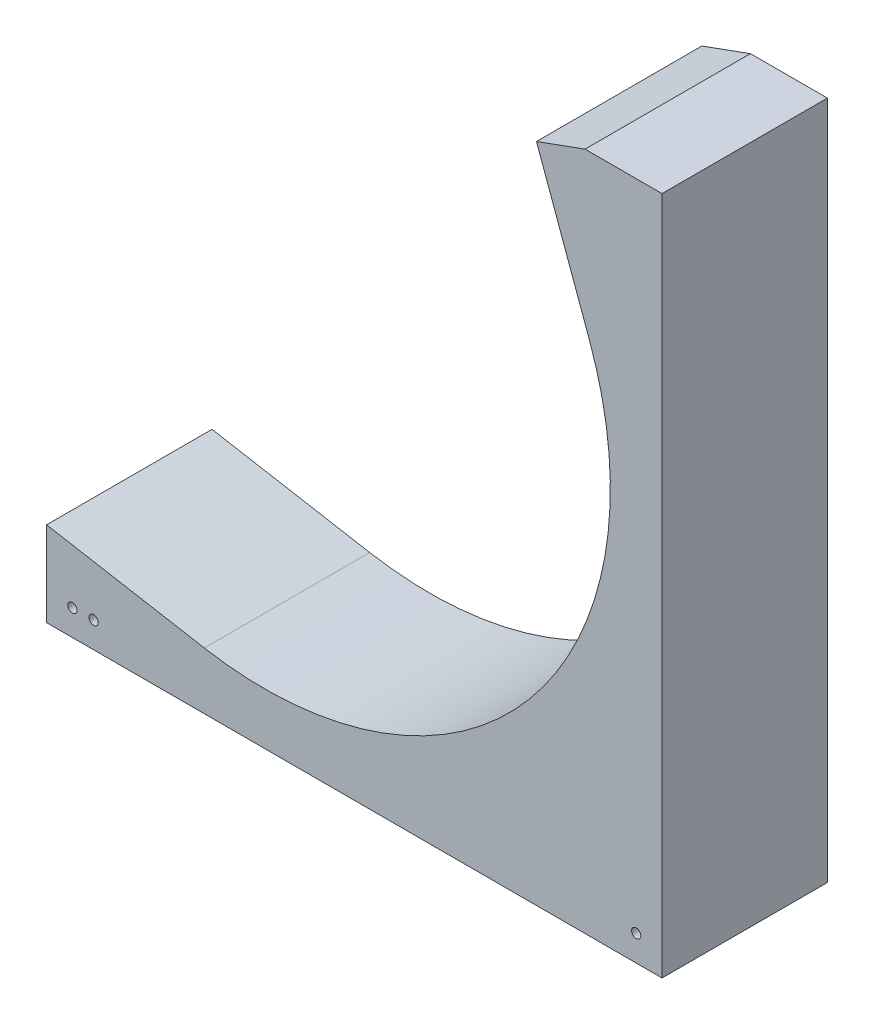
ISO-10303-21;
HEADER;
FILE_DESCRIPTION(('STEP AP214'),'2;1');
FILE_NAME('part.step','',(''),(''),'','','');
FILE_SCHEMA(('AUTOMOTIVE_DESIGN { 1 0 10303 214 1 1 1 1 }'));
ENDSEC;
DATA;
#1=APPLICATION_CONTEXT('core data for automotive mechanical design processes');
#2=APPLICATION_PROTOCOL_DEFINITION('international standard','automotive_design',2000,#1);
#3=PRODUCT_CONTEXT('',#1,'mechanical');
#4=PRODUCT('Part','Part','',(#3));
#5=PRODUCT_RELATED_PRODUCT_CATEGORY('part','',(#4));
#6=PRODUCT_DEFINITION_FORMATION('','',#4);
#7=PRODUCT_DEFINITION_CONTEXT('part definition',#1,'design');
#8=PRODUCT_DEFINITION('design','',#6,#7);
#9=PRODUCT_DEFINITION_SHAPE('','',#8);
#10=(LENGTH_UNIT() NAMED_UNIT(*) SI_UNIT(.MILLI.,.METRE.));
#11=(NAMED_UNIT(*) PLANE_ANGLE_UNIT() SI_UNIT($,.RADIAN.));
#12=(NAMED_UNIT(*) SI_UNIT($,.STERADIAN.) SOLID_ANGLE_UNIT());
#13=UNCERTAINTY_MEASURE_WITH_UNIT(LENGTH_MEASURE(1.E-05),#10,'distance_accuracy_value','');
#14=(GEOMETRIC_REPRESENTATION_CONTEXT(3) GLOBAL_UNCERTAINTY_ASSIGNED_CONTEXT((#13)) GLOBAL_UNIT_ASSIGNED_CONTEXT((#10,
#11,#12)) REPRESENTATION_CONTEXT('',''));
#15=CARTESIAN_POINT('',(0.,0.,0.));
#16=DIRECTION('',(0.,0.,1.));
#17=DIRECTION('',(1.,0.,0.));
#18=AXIS2_PLACEMENT_3D('',#15,#16,#17);
#19=CARTESIAN_POINT('',(-13.0309674607081,35.802288851943,0.));
#20=DIRECTION('',(0.342020143325672,-0.939692620785908,0.));
#21=DIRECTION('',(0.939692620785908,0.342020143325672,0.));
#22=AXIS2_PLACEMENT_3D('',#19,#20,#21);
#23=PLANE('',#22);
#24=DIRECTION('',(0.,0.,1.));
#25=VECTOR('',#24,1.);
#26=CARTESIAN_POINT('',(78.789969348242,69.2223767328391,-20.3199999999999));
#27=LINE('',#26,#25);
#28=CARTESIAN_POINT('',(78.7899693482419,69.2223767328391,-20.3200000000004));
#29=VERTEX_POINT('',#28);
#30=CARTESIAN_POINT('',(78.7899693482419,69.2223767328391,20.3199999999999));
#31=VERTEX_POINT('',#30);
#32=EDGE_CURVE('E189',#29,#31,#27,.T.);
#33=ORIENTED_EDGE('',*,*,#32,.F.);
#34=DIRECTION('',(0.939692620785907,0.342020143325671,0.));
#35=VECTOR('',#34,1.);
#36=CARTESIAN_POINT('',(78.789969348242,69.2223767328391,-20.3199999999999));
#37=LINE('',#36,#35);
#38=CARTESIAN_POINT('',(66.8558730642609,64.878720912603,-20.32));
#39=VERTEX_POINT('',#38);
#40=EDGE_CURVE('E207',#39,#29,#37,.T.);
#41=ORIENTED_EDGE('',*,*,#40,.F.);
#42=DIRECTION('',(0.,0.,-1.));
#43=VECTOR('',#42,1.);
#44=CARTESIAN_POINT('',(66.8558730642609,64.878720912603,-20.32));
#45=LINE('',#44,#43);
#46=CARTESIAN_POINT('',(66.8558730642608,64.878720912603,20.3200000000001));
#47=VERTEX_POINT('',#46);
#48=EDGE_CURVE('E202',#47,#39,#45,.T.);
#49=ORIENTED_EDGE('',*,*,#48,.F.);
#50=DIRECTION('',(-0.939692620785908,-0.342020143325672,0.));
#51=VECTOR('',#50,1.);
#52=CARTESIAN_POINT('',(78.7899693482419,69.2223767328391,20.3200000000001));
#53=LINE('',#52,#51);
#54=EDGE_CURVE('E192',#31,#47,#53,.T.);
#55=ORIENTED_EDGE('',*,*,#54,.F.);
#56=EDGE_LOOP('',(#33,#41,#49,#55));
#57=FACE_BOUND('',#56,.T.);
#58=ADVANCED_FACE('F93',(#57),#23,.F.);
#59=CARTESIAN_POINT('',(78.7899693482419,69.2223767328391,20.3200000000001));
#60=DIRECTION('',(0.,0.,1.));
#61=DIRECTION('',(1.,0.,0.));
#62=AXIS2_PLACEMENT_3D('',#59,#60,#61);
#63=PLANE('',#62);
#64=CARTESIAN_POINT('',(-47.1742910089514,-91.3638000000001,20.3199999999999));
#65=DIRECTION('',(0.,0.,1.));
#66=DIRECTION('',(1.,0.,0.));
#67=AXIS2_PLACEMENT_3D('',#64,#65,#66);
#68=CIRCLE('',#67,1.13030000000002);
#69=CARTESIAN_POINT('',(-46.0439910089514,-91.3638000000001,20.3199999999999));
#70=VERTEX_POINT('',#69);
#71=EDGE_CURVE('E365',#70,#70,#68,.T.);
#72=ORIENTED_EDGE('',*,*,#71,.F.);
#73=EDGE_LOOP('',(#72));
#74=FACE_BOUND('',#73,.T.);
#75=DIRECTION('',(-0.984807753012208,0.17364817766693,0.));
#76=VECTOR('',#75,1.);
#77=CARTESIAN_POINT('',(-14.7624914465408,-83.7222493530292,20.3200000000001));
#78=LINE('',#77,#76);
#79=CARTESIAN_POINT('',(-14.7624914465409,-83.7222493530292,20.3200000000001));
#80=VERTEX_POINT('',#79);
#81=CARTESIAN_POINT('',(-53.5242910089514,-76.8874982693626,20.3199999999999));
#82=VERTEX_POINT('',#81);
#83=EDGE_CURVE('E101',#80,#82,#78,.T.);
#84=ORIENTED_EDGE('',*,*,#83,.T.);
#85=DIRECTION('',(0.,1.,0.));
#86=VECTOR('',#85,1.);
#87=CARTESIAN_POINT('',(-53.5242910089514,-97.7138,20.3199999999999));
#88=LINE('',#87,#86);
#89=CARTESIAN_POINT('',(-53.5242910089514,-97.7138,20.3199999999999));
#90=VERTEX_POINT('',#89);
#91=EDGE_CURVE('E169',#90,#82,#88,.T.);
#92=ORIENTED_EDGE('',*,*,#91,.F.);
#93=DIRECTION('',(1.,0.,0.));
#94=VECTOR('',#93,1.);
#95=CARTESIAN_POINT('',(0.,-97.7137999999999,20.3199999999999));
#96=LINE('',#95,#94);
#97=CARTESIAN_POINT('',(97.7138,-97.7137999999999,20.3199999999999));
#98=VERTEX_POINT('',#97);
#99=EDGE_CURVE('E180',#90,#98,#96,.T.);
#100=ORIENTED_EDGE('',*,*,#99,.T.);
#101=DIRECTION('',(0.,1.,0.));
#102=VECTOR('',#101,1.);
#103=CARTESIAN_POINT('',(97.7138,0.,20.3199999999999));
#104=LINE('',#103,#102);
#105=CARTESIAN_POINT('',(97.7137999999999,69.2223767328391,20.3199999999999));
#106=VERTEX_POINT('',#105);
#107=EDGE_CURVE('E197',#98,#106,#104,.T.);
#108=ORIENTED_EDGE('',*,*,#107,.T.);
#109=DIRECTION('',(-1.,0.,0.));
#110=VECTOR('',#109,1.);
#111=CARTESIAN_POINT('',(0.,69.2223767328391,20.3199999999999));
#112=LINE('',#111,#110);
#113=EDGE_CURVE('E251',#106,#31,#112,.T.);
#114=ORIENTED_EDGE('',*,*,#113,.T.);
#115=ORIENTED_EDGE('',*,*,#54,.T.);
#116=DIRECTION('',(0.342020143325672,-0.939692620785907,0.));
#117=VECTOR('',#116,1.);
#118=CARTESIAN_POINT('',(66.8558730642608,64.878720912603,20.3200000000001));
#119=LINE('',#118,#117);
#120=CARTESIAN_POINT('',(79.8868405249689,29.07643206066,20.3200000000001));
#121=VERTEX_POINT('',#120);
#122=EDGE_CURVE('E206',#47,#121,#119,.T.);
#123=ORIENTED_EDGE('',*,*,#122,.T.);
#124=CARTESIAN_POINT('',(0.,0.,20.3200000000001));
#125=DIRECTION('',(0.,0.,-1.));
#126=DIRECTION('',(0.939692620785907,0.342020143325673,0.));
#127=AXIS2_PLACEMENT_3D('',#124,#125,#126);
#128=CIRCLE('',#127,85.0137999999999);
#129=EDGE_CURVE('E213',#121,#80,#128,.T.);
#130=ORIENTED_EDGE('',*,*,#129,.T.);
#131=EDGE_LOOP('',(#84,#92,#100,#108,#114,#115,#123,#130));
#132=FACE_BOUND('',#131,.T.);
#133=CARTESIAN_POINT('',(91.3637999999999,-91.3638000000001,20.3199999999999));
#134=DIRECTION('',(0.,0.,1.));
#135=DIRECTION('',(1.,0.,0.));
#136=AXIS2_PLACEMENT_3D('',#133,#134,#135);
#137=CIRCLE('',#136,1.1303);
#138=CARTESIAN_POINT('',(92.4940999999999,-91.3638000000001,20.3199999999999));
#139=VERTEX_POINT('',#138);
#140=EDGE_CURVE('E252',#139,#139,#137,.T.);
#141=ORIENTED_EDGE('',*,*,#140,.F.);
#142=EDGE_LOOP('',(#141));
#143=FACE_BOUND('',#142,.T.);
#144=CARTESIAN_POINT('',(-41.9735000000001,-91.3638000000001,20.3199999999999));
#145=DIRECTION('',(0.,0.,1.));
#146=DIRECTION('',(1.,0.,0.));
#147=AXIS2_PLACEMENT_3D('',#144,#145,#146);
#148=CIRCLE('',#147,1.13030000000001);
#149=CARTESIAN_POINT('',(-40.8432000000001,-91.3638000000001,20.3199999999999));
#150=VERTEX_POINT('',#149);
#151=EDGE_CURVE('E242',#150,#150,#148,.T.);
#152=ORIENTED_EDGE('',*,*,#151,.F.);
#153=EDGE_LOOP('',(#152));
#154=FACE_BOUND('',#153,.T.);
#155=ADVANCED_FACE('F178',(#74,#132,#143,#154),#63,.T.);
#156=CARTESIAN_POINT('',(66.8558730642609,64.878720912603,-20.32));
#157=DIRECTION('',(-0.939692620785907,-0.342020143325672,0.));
#158=DIRECTION('',(0.342020143325672,-0.939692620785907,0.));
#159=AXIS2_PLACEMENT_3D('',#156,#157,#158);
#160=PLANE('',#159);
#161=DIRECTION('',(0.342020143325672,-0.939692620785907,0.));
#162=VECTOR('',#161,1.);
#163=CARTESIAN_POINT('',(66.8558730642609,64.878720912603,-20.32));
#164=LINE('',#163,#162);
#165=CARTESIAN_POINT('',(79.886840524969,29.0764320606601,-20.32));
#166=VERTEX_POINT('',#165);
#167=EDGE_CURVE('E223',#39,#166,#164,.T.);
#168=ORIENTED_EDGE('',*,*,#167,.T.);
#169=DIRECTION('',(0.,0.,-1.));
#170=VECTOR('',#169,1.);
#171=CARTESIAN_POINT('',(79.886840524969,29.0764320606601,-20.32));
#172=LINE('',#171,#170);
#173=EDGE_CURVE('E210',#121,#166,#172,.T.);
#174=ORIENTED_EDGE('',*,*,#173,.F.);
#175=ORIENTED_EDGE('',*,*,#122,.F.);
#176=ORIENTED_EDGE('',*,*,#48,.T.);
#177=EDGE_LOOP('',(#168,#174,#175,#176));
#178=FACE_BOUND('',#177,.T.);
#179=ADVANCED_FACE('F277',(#178),#160,.T.);
#180=CARTESIAN_POINT('',(78.789969348242,69.2223767328391,-20.3199999999999));
#181=DIRECTION('',(0.,0.,-1.));
#182=DIRECTION('',(-1.,0.,0.));
#183=AXIS2_PLACEMENT_3D('',#180,#181,#182);
#184=PLANE('',#183);
#185=CARTESIAN_POINT('',(-47.1742910089514,-91.3638000000001,-20.3200000000004));
#186=DIRECTION('',(0.,0.,1.));
#187=DIRECTION('',(1.,0.,0.));
#188=AXIS2_PLACEMENT_3D('',#185,#186,#187);
#189=CIRCLE('',#188,1.13030000000002);
#190=CARTESIAN_POINT('',(-46.0439910089514,-91.3638000000001,-20.3200000000004));
#191=VERTEX_POINT('',#190);
#192=EDGE_CURVE('E183',#191,#191,#189,.T.);
#193=ORIENTED_EDGE('',*,*,#192,.T.);
#194=EDGE_LOOP('',(#193));
#195=FACE_BOUND('',#194,.T.);
#196=ORIENTED_EDGE('',*,*,#167,.F.);
#197=ORIENTED_EDGE('',*,*,#40,.T.);
#198=DIRECTION('',(-1.,0.,0.));
#199=VECTOR('',#198,1.);
#200=CARTESIAN_POINT('',(0.,69.2223767328391,-20.3200000000003));
#201=LINE('',#200,#199);
#202=CARTESIAN_POINT('',(97.7137999999999,69.2223767328391,-20.3200000000003));
#203=VERTEX_POINT('',#202);
#204=EDGE_CURVE('E260',#203,#29,#201,.T.);
#205=ORIENTED_EDGE('',*,*,#204,.F.);
#206=DIRECTION('',(0.,1.,0.));
#207=VECTOR('',#206,1.);
#208=CARTESIAN_POINT('',(97.7138,3.88578058618805E-13,-20.3200000000002));
#209=LINE('',#208,#207);
#210=CARTESIAN_POINT('',(97.7138,-97.7137999999999,-20.32));
#211=VERTEX_POINT('',#210);
#212=EDGE_CURVE('E194',#211,#203,#209,.T.);
#213=ORIENTED_EDGE('',*,*,#212,.F.);
#214=DIRECTION('',(1.,0.,0.));
#215=VECTOR('',#214,1.);
#216=CARTESIAN_POINT('',(0.,-97.7137999999999,-20.3199999999999));
#217=LINE('',#216,#215);
#218=CARTESIAN_POINT('',(-53.5242910089514,-97.7137999999999,-20.3199999999999));
#219=VERTEX_POINT('',#218);
#220=EDGE_CURVE('E190',#219,#211,#217,.T.);
#221=ORIENTED_EDGE('',*,*,#220,.F.);
#222=DIRECTION('',(0.,1.,0.));
#223=VECTOR('',#222,1.);
#224=CARTESIAN_POINT('',(-53.5242910089514,-97.7138,-20.3200000000004));
#225=LINE('',#224,#223);
#226=CARTESIAN_POINT('',(-53.5242910089514,-76.8874982693628,-20.3200000000004));
#227=VERTEX_POINT('',#226);
#228=EDGE_CURVE('E109',#219,#227,#225,.T.);
#229=ORIENTED_EDGE('',*,*,#228,.T.);
#230=DIRECTION('',(-0.984807753012208,0.17364817766693,0.));
#231=VECTOR('',#230,1.);
#232=CARTESIAN_POINT('',(-14.7624914465408,-83.7222493530293,-20.32));
#233=LINE('',#232,#231);
#234=CARTESIAN_POINT('',(-14.7624914465409,-83.7222493530293,-20.32));
#235=VERTEX_POINT('',#234);
#236=EDGE_CURVE('E14',#235,#227,#233,.T.);
#237=ORIENTED_EDGE('',*,*,#236,.F.);
#238=CARTESIAN_POINT('',(0.,0.,-20.32));
#239=DIRECTION('',(0.,0.,-1.));
#240=DIRECTION('',(0.939692620785907,0.342020143325673,0.));
#241=AXIS2_PLACEMENT_3D('',#238,#239,#240);
#242=CIRCLE('',#241,85.0138);
#243=EDGE_CURVE('E228',#166,#235,#242,.T.);
#244=ORIENTED_EDGE('',*,*,#243,.F.);
#245=EDGE_LOOP('',(#196,#197,#205,#213,#221,#229,#237,#244));
#246=FACE_BOUND('',#245,.T.);
#247=CARTESIAN_POINT('',(91.3637999999999,-91.3638000000001,-20.3200000000004));
#248=DIRECTION('',(0.,0.,1.));
#249=DIRECTION('',(1.,0.,0.));
#250=AXIS2_PLACEMENT_3D('',#247,#248,#249);
#251=CIRCLE('',#250,1.1303);
#252=CARTESIAN_POINT('',(92.4940999999999,-91.3638000000001,-20.3200000000004));
#253=VERTEX_POINT('',#252);
#254=EDGE_CURVE('E248',#253,#253,#251,.T.);
#255=ORIENTED_EDGE('',*,*,#254,.T.);
#256=EDGE_LOOP('',(#255));
#257=FACE_BOUND('',#256,.T.);
#258=CARTESIAN_POINT('',(-41.9735000000001,-91.3638000000001,-20.3200000000004));
#259=DIRECTION('',(0.,0.,1.));
#260=DIRECTION('',(1.,0.,0.));
#261=AXIS2_PLACEMENT_3D('',#258,#259,#260);
#262=CIRCLE('',#261,1.13030000000001);
#263=CARTESIAN_POINT('',(-40.8432000000001,-91.3638000000001,-20.3200000000004));
#264=VERTEX_POINT('',#263);
#265=EDGE_CURVE('E245',#264,#264,#262,.T.);
#266=ORIENTED_EDGE('',*,*,#265,.T.);
#267=EDGE_LOOP('',(#266));
#268=FACE_BOUND('',#267,.T.);
#269=ADVANCED_FACE('F233',(#195,#246,#257,#268),#184,.T.);
#270=CARTESIAN_POINT('',(0.,0.,0.));
#271=DIRECTION('',(0.,0.,-1.));
#272=DIRECTION('',(-1.,0.,0.));
#273=AXIS2_PLACEMENT_3D('',#270,#271,#272);
#274=CYLINDRICAL_SURFACE('',#273,85.0138);
#275=ORIENTED_EDGE('',*,*,#243,.T.);
#276=DIRECTION('',(0.,0.,-1.));
#277=VECTOR('',#276,1.);
#278=CARTESIAN_POINT('',(-14.7624914465409,-83.7222493530293,-20.32));
#279=LINE('',#278,#277);
#280=EDGE_CURVE('E217',#80,#235,#279,.T.);
#281=ORIENTED_EDGE('',*,*,#280,.F.);
#282=ORIENTED_EDGE('',*,*,#129,.F.);
#283=ORIENTED_EDGE('',*,*,#173,.T.);
#284=EDGE_LOOP('',(#275,#281,#282,#283));
#285=FACE_BOUND('',#284,.T.);
#286=ADVANCED_FACE('F238',(#285),#274,.F.);
#287=CARTESIAN_POINT('',(-14.7624914465408,-83.7222493530293,-20.32));
#288=DIRECTION('',(0.17364817766693,0.984807753012208,0.));
#289=DIRECTION('',(-0.984807753012208,0.17364817766693,0.));
#290=AXIS2_PLACEMENT_3D('',#287,#288,#289);
#291=PLANE('',#290);
#292=DIRECTION('',(0.,0.,-1.));
#293=VECTOR('',#292,1.);
#294=CARTESIAN_POINT('',(-53.5242910089514,-76.8874982693628,-20.32));
#295=LINE('',#294,#293);
#296=EDGE_CURVE('E174',#82,#227,#295,.T.);
#297=ORIENTED_EDGE('',*,*,#296,.F.);
#298=ORIENTED_EDGE('',*,*,#83,.F.);
#299=ORIENTED_EDGE('',*,*,#280,.T.);
#300=ORIENTED_EDGE('',*,*,#236,.T.);
#301=EDGE_LOOP('',(#297,#298,#299,#300));
#302=FACE_BOUND('',#301,.T.);
#303=ADVANCED_FACE('F241',(#302),#291,.T.);
#304=CARTESIAN_POINT('',(0.,-97.7137999999999,-158.508181191012));
#305=DIRECTION('',(0.,-1.,0.));
#306=DIRECTION('',(0.,0.,-1.));
#307=AXIS2_PLACEMENT_3D('',#304,#305,#306);
#308=PLANE('',#307);
#309=DIRECTION('',(0.,0.,1.));
#310=VECTOR('',#309,1.);
#311=CARTESIAN_POINT('',(-53.5242910089514,-97.7138,-20.3200000000004));
#312=LINE('',#311,#310);
#313=EDGE_CURVE('E166',#219,#90,#312,.T.);
#314=ORIENTED_EDGE('',*,*,#313,.F.);
#315=ORIENTED_EDGE('',*,*,#220,.T.);
#316=DIRECTION('',(0.,0.,1.));
#317=VECTOR('',#316,1.);
#318=CARTESIAN_POINT('',(97.7138,-97.7137999999999,-158.508181191012));
#319=LINE('',#318,#317);
#320=EDGE_CURVE('E187',#211,#98,#319,.T.);
#321=ORIENTED_EDGE('',*,*,#320,.T.);
#322=ORIENTED_EDGE('',*,*,#99,.F.);
#323=EDGE_LOOP('',(#314,#315,#321,#322));
#324=FACE_BOUND('',#323,.T.);
#325=ADVANCED_FACE('F185',(#324),#308,.T.);
#326=CARTESIAN_POINT('',(97.7138,0.,-158.508181191012));
#327=DIRECTION('',(1.,0.,0.));
#328=DIRECTION('',(0.,1.,0.));
#329=AXIS2_PLACEMENT_3D('',#326,#327,#328);
#330=PLANE('',#329);
#331=ORIENTED_EDGE('',*,*,#320,.F.);
#332=ORIENTED_EDGE('',*,*,#212,.T.);
#333=DIRECTION('',(0.,0.,1.));
#334=VECTOR('',#333,1.);
#335=CARTESIAN_POINT('',(97.7137999999999,69.2223767328391,-158.508181191012));
#336=LINE('',#335,#334);
#337=EDGE_CURVE('E257',#203,#106,#336,.T.);
#338=ORIENTED_EDGE('',*,*,#337,.T.);
#339=ORIENTED_EDGE('',*,*,#107,.F.);
#340=EDGE_LOOP('',(#331,#332,#338,#339));
#341=FACE_BOUND('',#340,.T.);
#342=ADVANCED_FACE('F267',(#341),#330,.T.);
#343=CARTESIAN_POINT('',(0.,69.2223767328391,-158.508181191012));
#344=DIRECTION('',(0.,1.,0.));
#345=DIRECTION('',(0.,0.,1.));
#346=AXIS2_PLACEMENT_3D('',#343,#344,#345);
#347=PLANE('',#346);
#348=ORIENTED_EDGE('',*,*,#337,.F.);
#349=ORIENTED_EDGE('',*,*,#204,.T.);
#350=ORIENTED_EDGE('',*,*,#32,.T.);
#351=ORIENTED_EDGE('',*,*,#113,.F.);
#352=EDGE_LOOP('',(#348,#349,#350,#351));
#353=FACE_BOUND('',#352,.T.);
#354=ADVANCED_FACE('F272',(#353),#347,.T.);
#355=CARTESIAN_POINT('',(-41.9735000000001,-91.3638000000001,-20.3200000000004));
#356=DIRECTION('',(0.,0.,1.));
#357=DIRECTION('',(1.,0.,0.));
#358=AXIS2_PLACEMENT_3D('',#355,#356,#357);
#359=CYLINDRICAL_SURFACE('',#358,1.13030000000001);
#360=ORIENTED_EDGE('',*,*,#265,.F.);
#361=EDGE_LOOP('',(#360));
#362=FACE_BOUND('',#361,.T.);
#363=ORIENTED_EDGE('',*,*,#151,.T.);
#364=EDGE_LOOP('',(#363));
#365=FACE_BOUND('',#364,.T.);
#366=ADVANCED_FACE('F329',(#362,#365),#359,.F.);
#367=CARTESIAN_POINT('',(91.3637999999999,-91.3638000000001,-20.3200000000004));
#368=DIRECTION('',(0.,0.,1.));
#369=DIRECTION('',(1.,0.,0.));
#370=AXIS2_PLACEMENT_3D('',#367,#368,#369);
#371=CYLINDRICAL_SURFACE('',#370,1.1303);
#372=ORIENTED_EDGE('',*,*,#254,.F.);
#373=EDGE_LOOP('',(#372));
#374=FACE_BOUND('',#373,.T.);
#375=ORIENTED_EDGE('',*,*,#140,.T.);
#376=EDGE_LOOP('',(#375));
#377=FACE_BOUND('',#376,.T.);
#378=ADVANCED_FACE('F336',(#374,#377),#371,.F.);
#379=CARTESIAN_POINT('',(-53.5242910089514,-97.7138,-20.3200000000004));
#380=DIRECTION('',(1.,0.,0.));
#381=DIRECTION('',(0.,0.,-1.));
#382=AXIS2_PLACEMENT_3D('',#379,#380,#381);
#383=PLANE('',#382);
#384=ORIENTED_EDGE('',*,*,#296,.T.);
#385=ORIENTED_EDGE('',*,*,#228,.F.);
#386=ORIENTED_EDGE('',*,*,#313,.T.);
#387=ORIENTED_EDGE('',*,*,#91,.T.);
#388=EDGE_LOOP('',(#384,#385,#386,#387));
#389=FACE_BOUND('',#388,.T.);
#390=ADVANCED_FACE('F168',(#389),#383,.F.);
#391=CARTESIAN_POINT('',(-47.1742910089514,-91.3638000000001,-20.3200000000004));
#392=DIRECTION('',(0.,0.,1.));
#393=DIRECTION('',(1.,0.,0.));
#394=AXIS2_PLACEMENT_3D('',#391,#392,#393);
#395=CYLINDRICAL_SURFACE('',#394,1.13030000000002);
#396=ORIENTED_EDGE('',*,*,#192,.F.);
#397=EDGE_LOOP('',(#396));
#398=FACE_BOUND('',#397,.T.);
#399=ORIENTED_EDGE('',*,*,#71,.T.);
#400=EDGE_LOOP('',(#399));
#401=FACE_BOUND('',#400,.T.);
#402=ADVANCED_FACE('F351',(#398,#401),#395,.F.);
#403=CLOSED_SHELL('',(#58,#155,#179,#269,#286,#303,#325,#342,#354,#366,#378,#390,#402));
#404=MANIFOLD_SOLID_BREP('B2',#403);
#405=ADVANCED_BREP_SHAPE_REPRESENTATION('',(#18,#404),#14);
#406=SHAPE_DEFINITION_REPRESENTATION(#9,#405);
ENDSEC;
END-ISO-10303-21;
